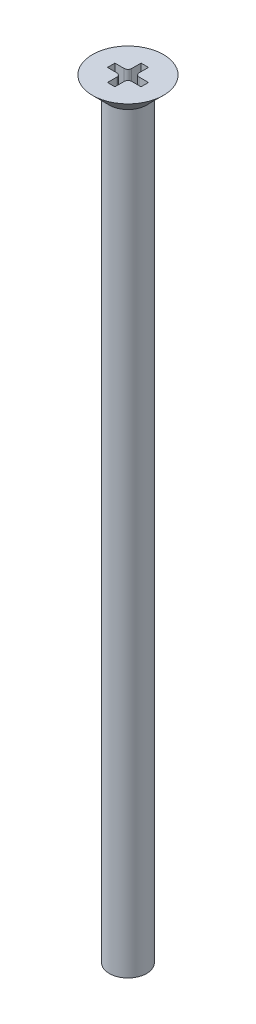
ISO-10303-21;
HEADER;
FILE_DESCRIPTION(('STEP AP214'),'2;1');
FILE_NAME('part.step','',(''),(''),'','','');
FILE_SCHEMA(('AUTOMOTIVE_DESIGN { 1 0 10303 214 1 1 1 1 }'));
ENDSEC;
DATA;
#1=APPLICATION_CONTEXT('core data for automotive mechanical design processes');
#2=APPLICATION_PROTOCOL_DEFINITION('international standard','automotive_design',2000,#1);
#3=PRODUCT_CONTEXT('',#1,'mechanical');
#4=PRODUCT('Part','Part','',(#3));
#5=PRODUCT_RELATED_PRODUCT_CATEGORY('part','',(#4));
#6=PRODUCT_DEFINITION_FORMATION('','',#4);
#7=PRODUCT_DEFINITION_CONTEXT('part definition',#1,'design');
#8=PRODUCT_DEFINITION('design','',#6,#7);
#9=PRODUCT_DEFINITION_SHAPE('','',#8);
#10=(LENGTH_UNIT() NAMED_UNIT(*) SI_UNIT(.MILLI.,.METRE.));
#11=(NAMED_UNIT(*) PLANE_ANGLE_UNIT() SI_UNIT($,.RADIAN.));
#12=(NAMED_UNIT(*) SI_UNIT($,.STERADIAN.) SOLID_ANGLE_UNIT());
#13=UNCERTAINTY_MEASURE_WITH_UNIT(LENGTH_MEASURE(1.E-05),#10,'distance_accuracy_value','');
#14=(GEOMETRIC_REPRESENTATION_CONTEXT(3) GLOBAL_UNCERTAINTY_ASSIGNED_CONTEXT((#13)) GLOBAL_UNIT_ASSIGNED_CONTEXT((#10,
#11,#12)) REPRESENTATION_CONTEXT('',''));
#15=CARTESIAN_POINT('',(0.,0.,0.));
#16=DIRECTION('',(0.,0.,1.));
#17=DIRECTION('',(1.,0.,0.));
#18=AXIS2_PLACEMENT_3D('',#15,#16,#17);
#19=CARTESIAN_POINT('',(0.,0.,0.));
#20=DIRECTION('',(0.,1.,0.));
#21=DIRECTION('',(0.,0.,1.));
#22=AXIS2_PLACEMENT_3D('',#19,#20,#21);
#23=PLANE('',#22);
#24=CARTESIAN_POINT('',(0.,0.,0.));
#25=DIRECTION('',(0.,1.,0.));
#26=DIRECTION('',(0.,0.,1.));
#27=AXIS2_PLACEMENT_3D('',#24,#25,#26);
#28=CIRCLE('',#27,1.9);
#29=CARTESIAN_POINT('',(0.,0.,1.9));
#30=VERTEX_POINT('',#29);
#31=EDGE_CURVE('E11',#30,#30,#28,.T.);
#32=ORIENTED_EDGE('',*,*,#31,.T.);
#33=EDGE_LOOP('',(#32));
#34=FACE_BOUND('',#33,.T.);
#35=DIRECTION('',(-1.,0.,0.));
#36=VECTOR('',#35,1.);
#37=CARTESIAN_POINT('',(0.4,0.,-0.2));
#38=LINE('',#37,#36);
#39=CARTESIAN_POINT('',(0.9,0.,-0.2));
#40=VERTEX_POINT('',#39);
#41=CARTESIAN_POINT('',(0.4,0.,-0.2));
#42=VERTEX_POINT('',#41);
#43=EDGE_CURVE('E49',#40,#42,#38,.T.);
#44=ORIENTED_EDGE('',*,*,#43,.F.);
#45=DIRECTION('',(0.,0.,-1.));
#46=VECTOR('',#45,1.);
#47=CARTESIAN_POINT('',(0.9,0.,0.2));
#48=LINE('',#47,#46);
#49=CARTESIAN_POINT('',(0.9,0.,0.2));
#50=VERTEX_POINT('',#49);
#51=EDGE_CURVE('E222',#50,#40,#48,.T.);
#52=ORIENTED_EDGE('',*,*,#51,.F.);
#53=DIRECTION('',(1.,0.,0.));
#54=VECTOR('',#53,1.);
#55=CARTESIAN_POINT('',(0.4,0.,0.2));
#56=LINE('',#55,#54);
#57=CARTESIAN_POINT('',(0.4,0.,0.2));
#58=VERTEX_POINT('',#57);
#59=EDGE_CURVE('E220',#58,#50,#56,.T.);
#60=ORIENTED_EDGE('',*,*,#59,.F.);
#61=CARTESIAN_POINT('',(0.4,0.,0.4));
#62=DIRECTION('',(0.,-1.,0.));
#63=DIRECTION('',(0.,0.,1.));
#64=AXIS2_PLACEMENT_3D('',#61,#62,#63);
#65=CIRCLE('',#64,0.2);
#66=CARTESIAN_POINT('',(0.2,0.,0.4));
#67=VERTEX_POINT('',#66);
#68=EDGE_CURVE('E157',#67,#58,#65,.T.);
#69=ORIENTED_EDGE('',*,*,#68,.F.);
#70=DIRECTION('',(0.,0.,-1.));
#71=VECTOR('',#70,1.);
#72=CARTESIAN_POINT('',(0.2,0.,0.9));
#73=LINE('',#72,#71);
#74=CARTESIAN_POINT('',(0.2,0.,0.9));
#75=VERTEX_POINT('',#74);
#76=EDGE_CURVE('E216',#75,#67,#73,.T.);
#77=ORIENTED_EDGE('',*,*,#76,.F.);
#78=DIRECTION('',(1.,0.,0.));
#79=VECTOR('',#78,1.);
#80=CARTESIAN_POINT('',(-0.2,0.,0.9));
#81=LINE('',#80,#79);
#82=CARTESIAN_POINT('',(-0.2,0.,0.9));
#83=VERTEX_POINT('',#82);
#84=EDGE_CURVE('E213',#83,#75,#81,.T.);
#85=ORIENTED_EDGE('',*,*,#84,.F.);
#86=DIRECTION('',(0.,0.,1.));
#87=VECTOR('',#86,1.);
#88=CARTESIAN_POINT('',(-0.2,0.,0.9));
#89=LINE('',#88,#87);
#90=CARTESIAN_POINT('',(-0.2,0.,0.4));
#91=VERTEX_POINT('',#90);
#92=EDGE_CURVE('E210',#91,#83,#89,.T.);
#93=ORIENTED_EDGE('',*,*,#92,.F.);
#94=CARTESIAN_POINT('',(-0.4,0.,0.4));
#95=DIRECTION('',(0.,-1.,0.));
#96=DIRECTION('',(0.,0.,1.));
#97=AXIS2_PLACEMENT_3D('',#94,#95,#96);
#98=CIRCLE('',#97,0.2);
#99=CARTESIAN_POINT('',(-0.4,0.,0.2));
#100=VERTEX_POINT('',#99);
#101=EDGE_CURVE('E207',#100,#91,#98,.T.);
#102=ORIENTED_EDGE('',*,*,#101,.F.);
#103=DIRECTION('',(1.,0.,0.));
#104=VECTOR('',#103,1.);
#105=CARTESIAN_POINT('',(-0.9,0.,0.2));
#106=LINE('',#105,#104);
#107=CARTESIAN_POINT('',(-0.9,0.,0.2));
#108=VERTEX_POINT('',#107);
#109=EDGE_CURVE('E204',#108,#100,#106,.T.);
#110=ORIENTED_EDGE('',*,*,#109,.F.);
#111=DIRECTION('',(0.,0.,1.));
#112=VECTOR('',#111,1.);
#113=CARTESIAN_POINT('',(-0.9,0.,0.2));
#114=LINE('',#113,#112);
#115=CARTESIAN_POINT('',(-0.9,0.,-0.2));
#116=VERTEX_POINT('',#115);
#117=EDGE_CURVE('E201',#116,#108,#114,.T.);
#118=ORIENTED_EDGE('',*,*,#117,.F.);
#119=DIRECTION('',(-1.,0.,0.));
#120=VECTOR('',#119,1.);
#121=CARTESIAN_POINT('',(-0.9,0.,-0.2));
#122=LINE('',#121,#120);
#123=CARTESIAN_POINT('',(-0.4,0.,-0.2));
#124=VERTEX_POINT('',#123);
#125=EDGE_CURVE('E198',#124,#116,#122,.T.);
#126=ORIENTED_EDGE('',*,*,#125,.F.);
#127=CARTESIAN_POINT('',(-0.4,0.,-0.4));
#128=DIRECTION('',(0.,-1.,0.));
#129=DIRECTION('',(0.,0.,1.));
#130=AXIS2_PLACEMENT_3D('',#127,#128,#129);
#131=CIRCLE('',#130,0.2);
#132=CARTESIAN_POINT('',(-0.2,0.,-0.4));
#133=VERTEX_POINT('',#132);
#134=EDGE_CURVE('E195',#133,#124,#131,.T.);
#135=ORIENTED_EDGE('',*,*,#134,.F.);
#136=DIRECTION('',(0.,0.,1.));
#137=VECTOR('',#136,1.);
#138=CARTESIAN_POINT('',(-0.2,0.,-0.4));
#139=LINE('',#138,#137);
#140=CARTESIAN_POINT('',(-0.2,0.,-0.9));
#141=VERTEX_POINT('',#140);
#142=EDGE_CURVE('E192',#141,#133,#139,.T.);
#143=ORIENTED_EDGE('',*,*,#142,.F.);
#144=DIRECTION('',(-1.,0.,0.));
#145=VECTOR('',#144,1.);
#146=CARTESIAN_POINT('',(-0.2,0.,-0.9));
#147=LINE('',#146,#145);
#148=CARTESIAN_POINT('',(0.2,0.,-0.9));
#149=VERTEX_POINT('',#148);
#150=EDGE_CURVE('E189',#149,#141,#147,.T.);
#151=ORIENTED_EDGE('',*,*,#150,.F.);
#152=DIRECTION('',(0.,0.,-1.));
#153=VECTOR('',#152,1.);
#154=CARTESIAN_POINT('',(0.2,0.,-0.4));
#155=LINE('',#154,#153);
#156=CARTESIAN_POINT('',(0.2,0.,-0.4));
#157=VERTEX_POINT('',#156);
#158=EDGE_CURVE('E186',#157,#149,#155,.T.);
#159=ORIENTED_EDGE('',*,*,#158,.F.);
#160=CARTESIAN_POINT('',(0.4,0.,-0.4));
#161=DIRECTION('',(0.,-1.,0.));
#162=DIRECTION('',(0.,0.,1.));
#163=AXIS2_PLACEMENT_3D('',#160,#161,#162);
#164=CIRCLE('',#163,0.2);
#165=EDGE_CURVE('E183',#42,#157,#164,.T.);
#166=ORIENTED_EDGE('',*,*,#165,.F.);
#167=EDGE_LOOP('',(#44,#52,#60,#69,#77,#85,#93,#102,#110,#118,#126,#135,#143,#151,#159,#166));
#168=FACE_BOUND('',#167,.T.);
#169=ADVANCED_FACE('F35',(#34,#168),#23,.T.);
#170=CARTESIAN_POINT('',(0.,0.,0.));
#171=DIRECTION('',(0.,1.,0.));
#172=DIRECTION('',(0.,0.,1.));
#173=AXIS2_PLACEMENT_3D('',#170,#171,#172);
#174=CONICAL_SURFACE('',#173,1.9,0.785398163397447);
#175=CARTESIAN_POINT('',(0.,-0.900000000000003,0.));
#176=DIRECTION('',(0.,1.,0.));
#177=DIRECTION('',(0.,0.,1.));
#178=AXIS2_PLACEMENT_3D('',#175,#176,#177);
#179=CIRCLE('',#178,1.);
#180=CARTESIAN_POINT('',(0.,-0.900000000000003,1.));
#181=VERTEX_POINT('',#180);
#182=EDGE_CURVE('E42',#181,#181,#179,.T.);
#183=ORIENTED_EDGE('',*,*,#182,.T.);
#184=EDGE_LOOP('',(#183));
#185=FACE_BOUND('',#184,.T.);
#186=ORIENTED_EDGE('',*,*,#31,.F.);
#187=EDGE_LOOP('',(#186));
#188=FACE_BOUND('',#187,.T.);
#189=ADVANCED_FACE('F256',(#185,#188),#174,.T.);
#190=CARTESIAN_POINT('',(0.,0.872326938896606,0.));
#191=DIRECTION('',(0.,1.,0.));
#192=DIRECTION('',(0.,0.,1.));
#193=AXIS2_PLACEMENT_3D('',#190,#191,#192);
#194=CYLINDRICAL_SURFACE('',#193,1.);
#195=ORIENTED_EDGE('',*,*,#182,.F.);
#196=EDGE_LOOP('',(#195));
#197=FACE_BOUND('',#196,.T.);
#198=CARTESIAN_POINT('',(0.,-41.2,0.));
#199=DIRECTION('',(0.,-1.,0.));
#200=DIRECTION('',(0.,0.,-1.));
#201=AXIS2_PLACEMENT_3D('',#198,#199,#200);
#202=CIRCLE('',#201,1.);
#203=CARTESIAN_POINT('',(0.,-41.2,-1.));
#204=VERTEX_POINT('',#203);
#205=EDGE_CURVE('E226',#204,#204,#202,.T.);
#206=ORIENTED_EDGE('',*,*,#205,.F.);
#207=EDGE_LOOP('',(#206));
#208=FACE_BOUND('',#207,.T.);
#209=ADVANCED_FACE('F259',(#197,#208),#194,.T.);
#210=CARTESIAN_POINT('',(0.,-41.2,0.));
#211=DIRECTION('',(0.,-1.,0.));
#212=DIRECTION('',(0.,0.,-1.));
#213=AXIS2_PLACEMENT_3D('',#210,#211,#212);
#214=PLANE('',#213);
#215=ORIENTED_EDGE('',*,*,#205,.T.);
#216=EDGE_LOOP('',(#215));
#217=FACE_BOUND('',#216,.T.);
#218=ADVANCED_FACE('F262',(#217),#214,.T.);
#219=CARTESIAN_POINT('',(0.4,-1.,-0.2));
#220=DIRECTION('',(0.,0.,-1.));
#221=DIRECTION('',(-1.,0.,0.));
#222=AXIS2_PLACEMENT_3D('',#219,#220,#221);
#223=PLANE('',#222);
#224=ORIENTED_EDGE('',*,*,#43,.T.);
#225=DIRECTION('',(0.,1.,0.));
#226=VECTOR('',#225,1.);
#227=CARTESIAN_POINT('',(0.4,-1.,-0.2));
#228=LINE('',#227,#226);
#229=CARTESIAN_POINT('',(0.4,-1.,-0.2));
#230=VERTEX_POINT('',#229);
#231=EDGE_CURVE('E109',#230,#42,#228,.T.);
#232=ORIENTED_EDGE('',*,*,#231,.F.);
#233=DIRECTION('',(-1.,0.,0.));
#234=VECTOR('',#233,1.);
#235=CARTESIAN_POINT('',(0.4,-1.,-0.2));
#236=LINE('',#235,#234);
#237=CARTESIAN_POINT('',(0.9,-1.,-0.2));
#238=VERTEX_POINT('',#237);
#239=EDGE_CURVE('E224',#238,#230,#236,.T.);
#240=ORIENTED_EDGE('',*,*,#239,.F.);
#241=DIRECTION('',(0.,1.,0.));
#242=VECTOR('',#241,1.);
#243=CARTESIAN_POINT('',(0.9,-1.,-0.2));
#244=LINE('',#243,#242);
#245=EDGE_CURVE('E57',#238,#40,#244,.T.);
#246=ORIENTED_EDGE('',*,*,#245,.T.);
#247=EDGE_LOOP('',(#224,#232,#240,#246));
#248=FACE_BOUND('',#247,.T.);
#249=ADVANCED_FACE('F267',(#248),#223,.F.);
#250=CARTESIAN_POINT('',(0.9,-1.,0.2));
#251=DIRECTION('',(1.,0.,0.));
#252=DIRECTION('',(0.,0.,-1.));
#253=AXIS2_PLACEMENT_3D('',#250,#251,#252);
#254=PLANE('',#253);
#255=ORIENTED_EDGE('',*,*,#51,.T.);
#256=ORIENTED_EDGE('',*,*,#245,.F.);
#257=DIRECTION('',(0.,0.,-1.));
#258=VECTOR('',#257,1.);
#259=CARTESIAN_POINT('',(0.9,-1.,0.2));
#260=LINE('',#259,#258);
#261=CARTESIAN_POINT('',(0.9,-1.,0.2));
#262=VERTEX_POINT('',#261);
#263=EDGE_CURVE('E169',#262,#238,#260,.T.);
#264=ORIENTED_EDGE('',*,*,#263,.F.);
#265=DIRECTION('',(0.,1.,0.));
#266=VECTOR('',#265,1.);
#267=CARTESIAN_POINT('',(0.9,-1.,0.2));
#268=LINE('',#267,#266);
#269=EDGE_CURVE('E161',#262,#50,#268,.T.);
#270=ORIENTED_EDGE('',*,*,#269,.T.);
#271=EDGE_LOOP('',(#255,#256,#264,#270));
#272=FACE_BOUND('',#271,.T.);
#273=ADVANCED_FACE('F272',(#272),#254,.F.);
#274=CARTESIAN_POINT('',(0.4,-1.,0.2));
#275=DIRECTION('',(0.,0.,1.));
#276=DIRECTION('',(1.,0.,0.));
#277=AXIS2_PLACEMENT_3D('',#274,#275,#276);
#278=PLANE('',#277);
#279=ORIENTED_EDGE('',*,*,#59,.T.);
#280=ORIENTED_EDGE('',*,*,#269,.F.);
#281=DIRECTION('',(1.,0.,0.));
#282=VECTOR('',#281,1.);
#283=CARTESIAN_POINT('',(0.4,-1.,0.2));
#284=LINE('',#283,#282);
#285=CARTESIAN_POINT('',(0.4,-1.,0.2));
#286=VERTEX_POINT('',#285);
#287=EDGE_CURVE('E165',#286,#262,#284,.T.);
#288=ORIENTED_EDGE('',*,*,#287,.F.);
#289=DIRECTION('',(0.,1.,0.));
#290=VECTOR('',#289,1.);
#291=CARTESIAN_POINT('',(0.4,-1.,0.2));
#292=LINE('',#291,#290);
#293=EDGE_CURVE('E150',#286,#58,#292,.T.);
#294=ORIENTED_EDGE('',*,*,#293,.T.);
#295=EDGE_LOOP('',(#279,#280,#288,#294));
#296=FACE_BOUND('',#295,.T.);
#297=ADVANCED_FACE('F166',(#296),#278,.F.);
#298=CARTESIAN_POINT('',(0.4,-1.,0.4));
#299=DIRECTION('',(0.,1.,0.));
#300=DIRECTION('',(0.,0.,1.));
#301=AXIS2_PLACEMENT_3D('',#298,#299,#300);
#302=CYLINDRICAL_SURFACE('',#301,0.2);
#303=ORIENTED_EDGE('',*,*,#68,.T.);
#304=ORIENTED_EDGE('',*,*,#293,.F.);
#305=CARTESIAN_POINT('',(0.4,-1.,0.4));
#306=DIRECTION('',(0.,-1.,0.));
#307=DIRECTION('',(0.,0.,1.));
#308=AXIS2_PLACEMENT_3D('',#305,#306,#307);
#309=CIRCLE('',#308,0.2);
#310=CARTESIAN_POINT('',(0.2,-1.,0.4));
#311=VERTEX_POINT('',#310);
#312=EDGE_CURVE('E154',#311,#286,#309,.T.);
#313=ORIENTED_EDGE('',*,*,#312,.F.);
#314=DIRECTION('',(0.,1.,0.));
#315=VECTOR('',#314,1.);
#316=CARTESIAN_POINT('',(0.2,-1.,0.4));
#317=LINE('',#316,#315);
#318=EDGE_CURVE('E162',#311,#67,#317,.T.);
#319=ORIENTED_EDGE('',*,*,#318,.T.);
#320=EDGE_LOOP('',(#303,#304,#313,#319));
#321=FACE_BOUND('',#320,.T.);
#322=ADVANCED_FACE('F152',(#321),#302,.T.);
#323=CARTESIAN_POINT('',(0.2,-1.,0.9));
#324=DIRECTION('',(1.,0.,0.));
#325=DIRECTION('',(0.,0.,-1.));
#326=AXIS2_PLACEMENT_3D('',#323,#324,#325);
#327=PLANE('',#326);
#328=ORIENTED_EDGE('',*,*,#76,.T.);
#329=ORIENTED_EDGE('',*,*,#318,.F.);
#330=DIRECTION('',(0.,0.,-1.));
#331=VECTOR('',#330,1.);
#332=CARTESIAN_POINT('',(0.2,-1.,0.9));
#333=LINE('',#332,#331);
#334=CARTESIAN_POINT('',(0.2,-1.,0.9));
#335=VERTEX_POINT('',#334);
#336=EDGE_CURVE('E175',#335,#311,#333,.T.);
#337=ORIENTED_EDGE('',*,*,#336,.F.);
#338=DIRECTION('',(0.,1.,0.));
#339=VECTOR('',#338,1.);
#340=CARTESIAN_POINT('',(0.2,-1.,0.9));
#341=LINE('',#340,#339);
#342=EDGE_CURVE('E229',#335,#75,#341,.T.);
#343=ORIENTED_EDGE('',*,*,#342,.T.);
#344=EDGE_LOOP('',(#328,#329,#337,#343));
#345=FACE_BOUND('',#344,.T.);
#346=ADVANCED_FACE('F326',(#345),#327,.F.);
#347=CARTESIAN_POINT('',(-0.2,-1.,0.9));
#348=DIRECTION('',(0.,0.,1.));
#349=DIRECTION('',(1.,0.,0.));
#350=AXIS2_PLACEMENT_3D('',#347,#348,#349);
#351=PLANE('',#350);
#352=ORIENTED_EDGE('',*,*,#84,.T.);
#353=ORIENTED_EDGE('',*,*,#342,.F.);
#354=DIRECTION('',(1.,0.,0.));
#355=VECTOR('',#354,1.);
#356=CARTESIAN_POINT('',(-0.2,-1.,0.9));
#357=LINE('',#356,#355);
#358=CARTESIAN_POINT('',(-0.2,-1.,0.9));
#359=VERTEX_POINT('',#358);
#360=EDGE_CURVE('E177',#359,#335,#357,.T.);
#361=ORIENTED_EDGE('',*,*,#360,.F.);
#362=DIRECTION('',(0.,1.,0.));
#363=VECTOR('',#362,1.);
#364=CARTESIAN_POINT('',(-0.2,-1.,0.9));
#365=LINE('',#364,#363);
#366=EDGE_CURVE('E231',#359,#83,#365,.T.);
#367=ORIENTED_EDGE('',*,*,#366,.T.);
#368=EDGE_LOOP('',(#352,#353,#361,#367));
#369=FACE_BOUND('',#368,.T.);
#370=ADVANCED_FACE('F322',(#369),#351,.F.);
#371=CARTESIAN_POINT('',(-0.2,-1.,0.9));
#372=DIRECTION('',(-1.,0.,0.));
#373=DIRECTION('',(0.,0.,1.));
#374=AXIS2_PLACEMENT_3D('',#371,#372,#373);
#375=PLANE('',#374);
#376=ORIENTED_EDGE('',*,*,#92,.T.);
#377=ORIENTED_EDGE('',*,*,#366,.F.);
#378=DIRECTION('',(0.,0.,1.));
#379=VECTOR('',#378,1.);
#380=CARTESIAN_POINT('',(-0.2,-1.,0.9));
#381=LINE('',#380,#379);
#382=CARTESIAN_POINT('',(-0.2,-1.,0.4));
#383=VERTEX_POINT('',#382);
#384=EDGE_CURVE('E317',#383,#359,#381,.T.);
#385=ORIENTED_EDGE('',*,*,#384,.F.);
#386=DIRECTION('',(0.,1.,0.));
#387=VECTOR('',#386,1.);
#388=CARTESIAN_POINT('',(-0.2,-1.,0.4));
#389=LINE('',#388,#387);
#390=EDGE_CURVE('E233',#383,#91,#389,.T.);
#391=ORIENTED_EDGE('',*,*,#390,.T.);
#392=EDGE_LOOP('',(#376,#377,#385,#391));
#393=FACE_BOUND('',#392,.T.);
#394=ADVANCED_FACE('F331',(#393),#375,.F.);
#395=CARTESIAN_POINT('',(-0.4,-1.,0.4));
#396=DIRECTION('',(0.,1.,0.));
#397=DIRECTION('',(0.,0.,1.));
#398=AXIS2_PLACEMENT_3D('',#395,#396,#397);
#399=CYLINDRICAL_SURFACE('',#398,0.2);
#400=ORIENTED_EDGE('',*,*,#101,.T.);
#401=ORIENTED_EDGE('',*,*,#390,.F.);
#402=CARTESIAN_POINT('',(-0.4,-1.,0.4));
#403=DIRECTION('',(0.,-1.,0.));
#404=DIRECTION('',(0.,0.,1.));
#405=AXIS2_PLACEMENT_3D('',#402,#403,#404);
#406=CIRCLE('',#405,0.2);
#407=CARTESIAN_POINT('',(-0.4,-1.,0.2));
#408=VERTEX_POINT('',#407);
#409=EDGE_CURVE('E314',#408,#383,#406,.T.);
#410=ORIENTED_EDGE('',*,*,#409,.F.);
#411=DIRECTION('',(0.,1.,0.));
#412=VECTOR('',#411,1.);
#413=CARTESIAN_POINT('',(-0.4,-1.,0.2));
#414=LINE('',#413,#412);
#415=EDGE_CURVE('E235',#408,#100,#414,.T.);
#416=ORIENTED_EDGE('',*,*,#415,.T.);
#417=EDGE_LOOP('',(#400,#401,#410,#416));
#418=FACE_BOUND('',#417,.T.);
#419=ADVANCED_FACE('F334',(#418),#399,.T.);
#420=CARTESIAN_POINT('',(-0.9,-1.,0.2));
#421=DIRECTION('',(0.,0.,1.));
#422=DIRECTION('',(1.,0.,0.));
#423=AXIS2_PLACEMENT_3D('',#420,#421,#422);
#424=PLANE('',#423);
#425=ORIENTED_EDGE('',*,*,#109,.T.);
#426=ORIENTED_EDGE('',*,*,#415,.F.);
#427=DIRECTION('',(1.,0.,0.));
#428=VECTOR('',#427,1.);
#429=CARTESIAN_POINT('',(-0.9,-1.,0.2));
#430=LINE('',#429,#428);
#431=CARTESIAN_POINT('',(-0.9,-1.,0.2));
#432=VERTEX_POINT('',#431);
#433=EDGE_CURVE('E311',#432,#408,#430,.T.);
#434=ORIENTED_EDGE('',*,*,#433,.F.);
#435=DIRECTION('',(0.,1.,0.));
#436=VECTOR('',#435,1.);
#437=CARTESIAN_POINT('',(-0.9,-1.,0.2));
#438=LINE('',#437,#436);
#439=EDGE_CURVE('E237',#432,#108,#438,.T.);
#440=ORIENTED_EDGE('',*,*,#439,.T.);
#441=EDGE_LOOP('',(#425,#426,#434,#440));
#442=FACE_BOUND('',#441,.T.);
#443=ADVANCED_FACE('F337',(#442),#424,.F.);
#444=CARTESIAN_POINT('',(-0.9,-1.,0.2));
#445=DIRECTION('',(-1.,0.,0.));
#446=DIRECTION('',(0.,0.,1.));
#447=AXIS2_PLACEMENT_3D('',#444,#445,#446);
#448=PLANE('',#447);
#449=ORIENTED_EDGE('',*,*,#117,.T.);
#450=ORIENTED_EDGE('',*,*,#439,.F.);
#451=DIRECTION('',(0.,0.,1.));
#452=VECTOR('',#451,1.);
#453=CARTESIAN_POINT('',(-0.9,-1.,0.2));
#454=LINE('',#453,#452);
#455=CARTESIAN_POINT('',(-0.9,-1.,-0.2));
#456=VERTEX_POINT('',#455);
#457=EDGE_CURVE('E308',#456,#432,#454,.T.);
#458=ORIENTED_EDGE('',*,*,#457,.F.);
#459=DIRECTION('',(0.,1.,0.));
#460=VECTOR('',#459,1.);
#461=CARTESIAN_POINT('',(-0.9,-1.,-0.2));
#462=LINE('',#461,#460);
#463=EDGE_CURVE('E239',#456,#116,#462,.T.);
#464=ORIENTED_EDGE('',*,*,#463,.T.);
#465=EDGE_LOOP('',(#449,#450,#458,#464));
#466=FACE_BOUND('',#465,.T.);
#467=ADVANCED_FACE('F342',(#466),#448,.F.);
#468=CARTESIAN_POINT('',(-0.9,-1.,-0.2));
#469=DIRECTION('',(0.,0.,-1.));
#470=DIRECTION('',(-1.,0.,0.));
#471=AXIS2_PLACEMENT_3D('',#468,#469,#470);
#472=PLANE('',#471);
#473=ORIENTED_EDGE('',*,*,#125,.T.);
#474=ORIENTED_EDGE('',*,*,#463,.F.);
#475=DIRECTION('',(-1.,0.,0.));
#476=VECTOR('',#475,1.);
#477=CARTESIAN_POINT('',(-0.9,-1.,-0.2));
#478=LINE('',#477,#476);
#479=CARTESIAN_POINT('',(-0.4,-1.,-0.2));
#480=VERTEX_POINT('',#479);
#481=EDGE_CURVE('E305',#480,#456,#478,.T.);
#482=ORIENTED_EDGE('',*,*,#481,.F.);
#483=DIRECTION('',(0.,1.,0.));
#484=VECTOR('',#483,1.);
#485=CARTESIAN_POINT('',(-0.4,-1.,-0.2));
#486=LINE('',#485,#484);
#487=EDGE_CURVE('E241',#480,#124,#486,.T.);
#488=ORIENTED_EDGE('',*,*,#487,.T.);
#489=EDGE_LOOP('',(#473,#474,#482,#488));
#490=FACE_BOUND('',#489,.T.);
#491=ADVANCED_FACE('F346',(#490),#472,.F.);
#492=CARTESIAN_POINT('',(-0.4,-1.,-0.4));
#493=DIRECTION('',(0.,1.,0.));
#494=DIRECTION('',(0.,0.,1.));
#495=AXIS2_PLACEMENT_3D('',#492,#493,#494);
#496=CYLINDRICAL_SURFACE('',#495,0.2);
#497=ORIENTED_EDGE('',*,*,#134,.T.);
#498=ORIENTED_EDGE('',*,*,#487,.F.);
#499=CARTESIAN_POINT('',(-0.4,-1.,-0.4));
#500=DIRECTION('',(0.,-1.,0.));
#501=DIRECTION('',(0.,0.,1.));
#502=AXIS2_PLACEMENT_3D('',#499,#500,#501);
#503=CIRCLE('',#502,0.2);
#504=CARTESIAN_POINT('',(-0.2,-1.,-0.4));
#505=VERTEX_POINT('',#504);
#506=EDGE_CURVE('E302',#505,#480,#503,.T.);
#507=ORIENTED_EDGE('',*,*,#506,.F.);
#508=DIRECTION('',(0.,1.,0.));
#509=VECTOR('',#508,1.);
#510=CARTESIAN_POINT('',(-0.2,-1.,-0.4));
#511=LINE('',#510,#509);
#512=EDGE_CURVE('E243',#505,#133,#511,.T.);
#513=ORIENTED_EDGE('',*,*,#512,.T.);
#514=EDGE_LOOP('',(#497,#498,#507,#513));
#515=FACE_BOUND('',#514,.T.);
#516=ADVANCED_FACE('F349',(#515),#496,.T.);
#517=CARTESIAN_POINT('',(-0.2,-1.,-0.4));
#518=DIRECTION('',(-1.,0.,0.));
#519=DIRECTION('',(0.,0.,1.));
#520=AXIS2_PLACEMENT_3D('',#517,#518,#519);
#521=PLANE('',#520);
#522=ORIENTED_EDGE('',*,*,#142,.T.);
#523=ORIENTED_EDGE('',*,*,#512,.F.);
#524=DIRECTION('',(0.,0.,1.));
#525=VECTOR('',#524,1.);
#526=CARTESIAN_POINT('',(-0.2,-1.,-0.4));
#527=LINE('',#526,#525);
#528=CARTESIAN_POINT('',(-0.2,-1.,-0.9));
#529=VERTEX_POINT('',#528);
#530=EDGE_CURVE('E299',#529,#505,#527,.T.);
#531=ORIENTED_EDGE('',*,*,#530,.F.);
#532=DIRECTION('',(0.,1.,0.));
#533=VECTOR('',#532,1.);
#534=CARTESIAN_POINT('',(-0.2,-1.,-0.9));
#535=LINE('',#534,#533);
#536=EDGE_CURVE('E245',#529,#141,#535,.T.);
#537=ORIENTED_EDGE('',*,*,#536,.T.);
#538=EDGE_LOOP('',(#522,#523,#531,#537));
#539=FACE_BOUND('',#538,.T.);
#540=ADVANCED_FACE('F352',(#539),#521,.F.);
#541=CARTESIAN_POINT('',(-0.2,-1.,-0.9));
#542=DIRECTION('',(0.,0.,-1.));
#543=DIRECTION('',(-1.,0.,0.));
#544=AXIS2_PLACEMENT_3D('',#541,#542,#543);
#545=PLANE('',#544);
#546=ORIENTED_EDGE('',*,*,#150,.T.);
#547=ORIENTED_EDGE('',*,*,#536,.F.);
#548=DIRECTION('',(-1.,0.,0.));
#549=VECTOR('',#548,1.);
#550=CARTESIAN_POINT('',(-0.2,-1.,-0.9));
#551=LINE('',#550,#549);
#552=CARTESIAN_POINT('',(0.2,-1.,-0.9));
#553=VERTEX_POINT('',#552);
#554=EDGE_CURVE('E296',#553,#529,#551,.T.);
#555=ORIENTED_EDGE('',*,*,#554,.F.);
#556=DIRECTION('',(0.,1.,0.));
#557=VECTOR('',#556,1.);
#558=CARTESIAN_POINT('',(0.2,-1.,-0.9));
#559=LINE('',#558,#557);
#560=EDGE_CURVE('E247',#553,#149,#559,.T.);
#561=ORIENTED_EDGE('',*,*,#560,.T.);
#562=EDGE_LOOP('',(#546,#547,#555,#561));
#563=FACE_BOUND('',#562,.T.);
#564=ADVANCED_FACE('F356',(#563),#545,.F.);
#565=CARTESIAN_POINT('',(0.2,-1.,-0.4));
#566=DIRECTION('',(1.,0.,0.));
#567=DIRECTION('',(0.,0.,-1.));
#568=AXIS2_PLACEMENT_3D('',#565,#566,#567);
#569=PLANE('',#568);
#570=ORIENTED_EDGE('',*,*,#158,.T.);
#571=ORIENTED_EDGE('',*,*,#560,.F.);
#572=DIRECTION('',(0.,0.,-1.));
#573=VECTOR('',#572,1.);
#574=CARTESIAN_POINT('',(0.2,-1.,-0.4));
#575=LINE('',#574,#573);
#576=CARTESIAN_POINT('',(0.2,-1.,-0.4));
#577=VERTEX_POINT('',#576);
#578=EDGE_CURVE('E291',#577,#553,#575,.T.);
#579=ORIENTED_EDGE('',*,*,#578,.F.);
#580=DIRECTION('',(0.,1.,0.));
#581=VECTOR('',#580,1.);
#582=CARTESIAN_POINT('',(0.2,-1.,-0.4));
#583=LINE('',#582,#581);
#584=EDGE_CURVE('E249',#577,#157,#583,.T.);
#585=ORIENTED_EDGE('',*,*,#584,.T.);
#586=EDGE_LOOP('',(#570,#571,#579,#585));
#587=FACE_BOUND('',#586,.T.);
#588=ADVANCED_FACE('F358',(#587),#569,.F.);
#589=CARTESIAN_POINT('',(0.4,-1.,-0.4));
#590=DIRECTION('',(0.,1.,0.));
#591=DIRECTION('',(0.,0.,1.));
#592=AXIS2_PLACEMENT_3D('',#589,#590,#591);
#593=CYLINDRICAL_SURFACE('',#592,0.2);
#594=ORIENTED_EDGE('',*,*,#165,.T.);
#595=ORIENTED_EDGE('',*,*,#584,.F.);
#596=CARTESIAN_POINT('',(0.4,-1.,-0.4));
#597=DIRECTION('',(0.,-1.,0.));
#598=DIRECTION('',(0.,0.,1.));
#599=AXIS2_PLACEMENT_3D('',#596,#597,#598);
#600=CIRCLE('',#599,0.2);
#601=EDGE_CURVE('E289',#230,#577,#600,.T.);
#602=ORIENTED_EDGE('',*,*,#601,.F.);
#603=ORIENTED_EDGE('',*,*,#231,.T.);
#604=EDGE_LOOP('',(#594,#595,#602,#603));
#605=FACE_BOUND('',#604,.T.);
#606=ADVANCED_FACE('F286',(#605),#593,.T.);
#607=CARTESIAN_POINT('',(0.4,-1.,0.4));
#608=DIRECTION('',(0.,1.,0.));
#609=DIRECTION('',(0.,0.,1.));
#610=AXIS2_PLACEMENT_3D('',#607,#608,#609);
#611=PLANE('',#610);
#612=ORIENTED_EDGE('',*,*,#239,.T.);
#613=ORIENTED_EDGE('',*,*,#601,.T.);
#614=ORIENTED_EDGE('',*,*,#578,.T.);
#615=ORIENTED_EDGE('',*,*,#554,.T.);
#616=ORIENTED_EDGE('',*,*,#530,.T.);
#617=ORIENTED_EDGE('',*,*,#506,.T.);
#618=ORIENTED_EDGE('',*,*,#481,.T.);
#619=ORIENTED_EDGE('',*,*,#457,.T.);
#620=ORIENTED_EDGE('',*,*,#433,.T.);
#621=ORIENTED_EDGE('',*,*,#409,.T.);
#622=ORIENTED_EDGE('',*,*,#384,.T.);
#623=ORIENTED_EDGE('',*,*,#360,.T.);
#624=ORIENTED_EDGE('',*,*,#336,.T.);
#625=ORIENTED_EDGE('',*,*,#312,.T.);
#626=ORIENTED_EDGE('',*,*,#287,.T.);
#627=ORIENTED_EDGE('',*,*,#263,.T.);
#628=EDGE_LOOP('',(#612,#613,#614,#615,#616,#617,#618,#619,#620,#621,#622,#623,#624,#625,#626,#627));
#629=FACE_BOUND('',#628,.T.);
#630=ADVANCED_FACE('F172',(#629),#611,.T.);
#631=CLOSED_SHELL('',(#169,#189,#209,#218,#249,#273,#297,#322,#346,#370,#394,#419,#443,#467,
#491,#516,#540,#564,#588,#606,#630));
#632=MANIFOLD_SOLID_BREP('B2',#631);
#633=ADVANCED_BREP_SHAPE_REPRESENTATION('',(#18,#632),#14);
#634=SHAPE_DEFINITION_REPRESENTATION(#9,#633);
ENDSEC;
END-ISO-10303-21;
